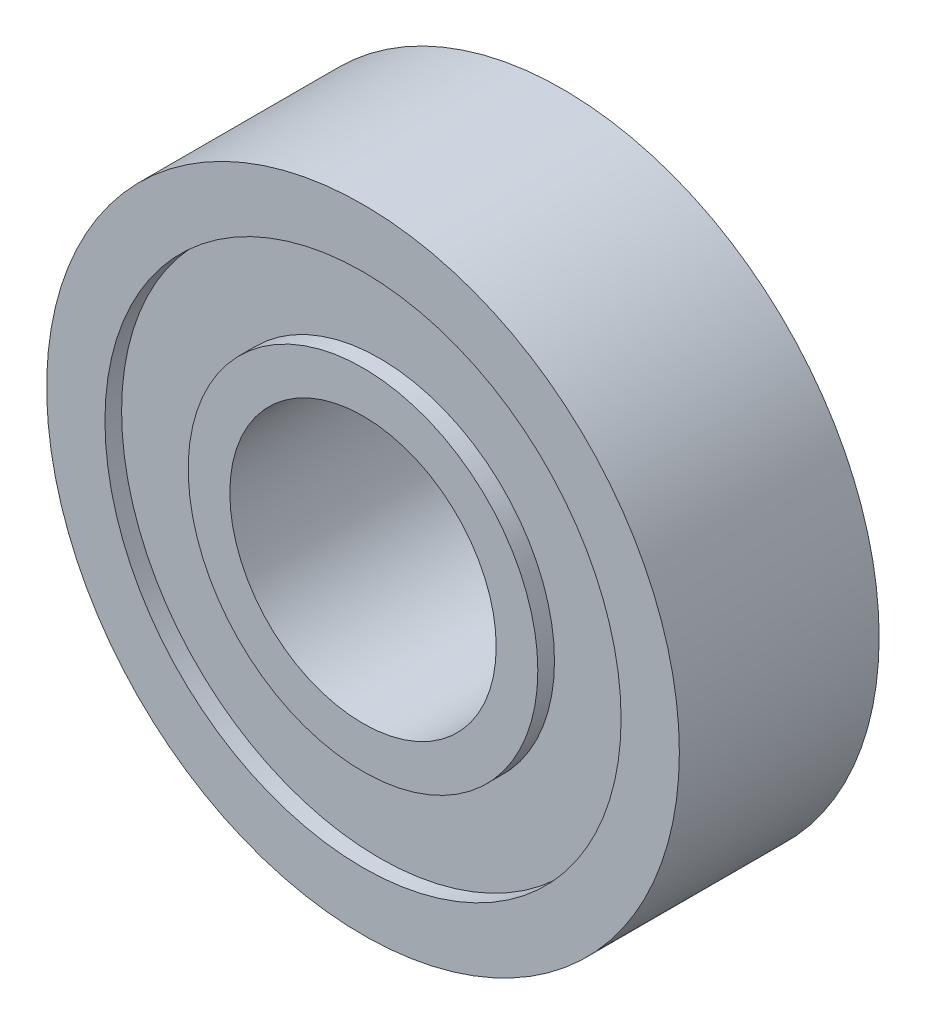
ISO-10303-21;
HEADER;
FILE_DESCRIPTION(('STEP AP214'),'2;1');
FILE_NAME('part.step','',(''),(''),'','','');
FILE_SCHEMA(('AUTOMOTIVE_DESIGN { 1 0 10303 214 1 1 1 1 }'));
ENDSEC;
DATA;
#1=APPLICATION_CONTEXT('core data for automotive mechanical design processes');
#2=APPLICATION_PROTOCOL_DEFINITION('international standard','automotive_design',2000,#1);
#3=PRODUCT_CONTEXT('',#1,'mechanical');
#4=PRODUCT('Part','Part','',(#3));
#5=PRODUCT_RELATED_PRODUCT_CATEGORY('part','',(#4));
#6=PRODUCT_DEFINITION_FORMATION('','',#4);
#7=PRODUCT_DEFINITION_CONTEXT('part definition',#1,'design');
#8=PRODUCT_DEFINITION('design','',#6,#7);
#9=PRODUCT_DEFINITION_SHAPE('','',#8);
#10=(LENGTH_UNIT() NAMED_UNIT(*) SI_UNIT(.MILLI.,.METRE.));
#11=(NAMED_UNIT(*) PLANE_ANGLE_UNIT() SI_UNIT($,.RADIAN.));
#12=(NAMED_UNIT(*) SI_UNIT($,.STERADIAN.) SOLID_ANGLE_UNIT());
#13=UNCERTAINTY_MEASURE_WITH_UNIT(LENGTH_MEASURE(1.E-05),#10,'distance_accuracy_value','');
#14=(GEOMETRIC_REPRESENTATION_CONTEXT(3) GLOBAL_UNCERTAINTY_ASSIGNED_CONTEXT((#13)) GLOBAL_UNIT_ASSIGNED_CONTEXT((#10,
#11,#12)) REPRESENTATION_CONTEXT('',''));
#15=CARTESIAN_POINT('',(0.,0.,0.));
#16=DIRECTION('',(0.,0.,1.));
#17=DIRECTION('',(1.,0.,0.));
#18=AXIS2_PLACEMENT_3D('',#15,#16,#17);
#19=CARTESIAN_POINT('',(0.,0.,-3.));
#20=DIRECTION('',(0.,0.,1.));
#21=DIRECTION('',(1.,0.,0.));
#22=AXIS2_PLACEMENT_3D('',#19,#20,#21);
#23=PLANE('',#22);
#24=CARTESIAN_POINT('',(0.,0.,-3.));
#25=DIRECTION('',(0.,0.,1.));
#26=DIRECTION('',(1.,0.,0.));
#27=AXIS2_PLACEMENT_3D('',#24,#25,#26);
#28=CIRCLE('',#27,4.);
#29=CARTESIAN_POINT('',(4.,0.,-3.));
#30=VERTEX_POINT('',#29);
#31=EDGE_CURVE('E41',#30,#30,#28,.T.);
#32=ORIENTED_EDGE('',*,*,#31,.T.);
#33=EDGE_LOOP('',(#32));
#34=FACE_BOUND('',#33,.T.);
#35=CARTESIAN_POINT('',(0.,0.,-3.));
#36=DIRECTION('',(0.,0.,1.));
#37=DIRECTION('',(1.,0.,0.));
#38=AXIS2_PLACEMENT_3D('',#35,#36,#37);
#39=CIRCLE('',#38,5.25);
#40=CARTESIAN_POINT('',(5.25,0.,-3.));
#41=VERTEX_POINT('',#40);
#42=EDGE_CURVE('E67',#41,#41,#39,.T.);
#43=ORIENTED_EDGE('',*,*,#42,.F.);
#44=EDGE_LOOP('',(#43));
#45=FACE_BOUND('',#44,.T.);
#46=ADVANCED_FACE('F30',(#34,#45),#23,.F.);
#47=CARTESIAN_POINT('',(0.,0.,3.));
#48=DIRECTION('',(0.,0.,1.));
#49=DIRECTION('',(1.,0.,0.));
#50=AXIS2_PLACEMENT_3D('',#47,#48,#49);
#51=PLANE('',#50);
#52=CARTESIAN_POINT('',(0.,0.,3.));
#53=DIRECTION('',(0.,0.,1.));
#54=DIRECTION('',(1.,0.,0.));
#55=AXIS2_PLACEMENT_3D('',#52,#53,#54);
#56=CIRCLE('',#55,4.);
#57=CARTESIAN_POINT('',(4.,0.,3.));
#58=VERTEX_POINT('',#57);
#59=EDGE_CURVE('E43',#58,#58,#56,.T.);
#60=ORIENTED_EDGE('',*,*,#59,.F.);
#61=EDGE_LOOP('',(#60));
#62=FACE_BOUND('',#61,.T.);
#63=CARTESIAN_POINT('',(0.,0.,3.));
#64=DIRECTION('',(0.,0.,1.));
#65=DIRECTION('',(1.,0.,0.));
#66=AXIS2_PLACEMENT_3D('',#63,#64,#65);
#67=CIRCLE('',#66,5.25);
#68=CARTESIAN_POINT('',(5.25,0.,3.));
#69=VERTEX_POINT('',#68);
#70=EDGE_CURVE('E55',#69,#69,#67,.T.);
#71=ORIENTED_EDGE('',*,*,#70,.T.);
#72=EDGE_LOOP('',(#71));
#73=FACE_BOUND('',#72,.T.);
#74=ADVANCED_FACE('F83',(#62,#73),#51,.T.);
#75=CARTESIAN_POINT('',(0.,0.,3.));
#76=DIRECTION('',(0.,0.,-1.));
#77=DIRECTION('',(-1.,0.,0.));
#78=AXIS2_PLACEMENT_3D('',#75,#76,#77);
#79=CYLINDRICAL_SURFACE('',#78,9.5);
#80=CARTESIAN_POINT('',(0.,0.,3.));
#81=DIRECTION('',(0.,0.,1.));
#82=DIRECTION('',(1.,0.,0.));
#83=AXIS2_PLACEMENT_3D('',#80,#81,#82);
#84=CIRCLE('',#83,9.5);
#85=CARTESIAN_POINT('',(9.5,0.,3.));
#86=VERTEX_POINT('',#85);
#87=EDGE_CURVE('E10',#86,#86,#84,.T.);
#88=ORIENTED_EDGE('',*,*,#87,.F.);
#89=EDGE_LOOP('',(#88));
#90=FACE_BOUND('',#89,.T.);
#91=CARTESIAN_POINT('',(0.,0.,-3.));
#92=DIRECTION('',(0.,0.,1.));
#93=DIRECTION('',(1.,0.,0.));
#94=AXIS2_PLACEMENT_3D('',#91,#92,#93);
#95=CIRCLE('',#94,9.5);
#96=CARTESIAN_POINT('',(9.5,0.,-3.));
#97=VERTEX_POINT('',#96);
#98=EDGE_CURVE('E34',#97,#97,#95,.T.);
#99=ORIENTED_EDGE('',*,*,#98,.T.);
#100=EDGE_LOOP('',(#99));
#101=FACE_BOUND('',#100,.T.);
#102=ADVANCED_FACE('F32',(#90,#101),#79,.T.);
#103=CARTESIAN_POINT('',(0.,0.,3.));
#104=DIRECTION('',(0.,0.,1.));
#105=DIRECTION('',(1.,0.,0.));
#106=AXIS2_PLACEMENT_3D('',#103,#104,#105);
#107=CIRCLE('',#106,7.75);
#108=CARTESIAN_POINT('',(7.75,0.,3.));
#109=VERTEX_POINT('',#108);
#110=EDGE_CURVE('E49',#109,#109,#107,.T.);
#111=ORIENTED_EDGE('',*,*,#110,.F.);
#112=EDGE_LOOP('',(#111));
#113=FACE_BOUND('',#112,.T.);
#114=ORIENTED_EDGE('',*,*,#87,.T.);
#115=EDGE_LOOP('',(#114));
#116=FACE_BOUND('',#115,.T.);
#117=ADVANCED_FACE('F91',(#113,#116),#51,.T.);
#118=CARTESIAN_POINT('',(0.,0.,-3.));
#119=DIRECTION('',(0.,0.,1.));
#120=DIRECTION('',(1.,0.,0.));
#121=AXIS2_PLACEMENT_3D('',#118,#119,#120);
#122=CIRCLE('',#121,7.75);
#123=CARTESIAN_POINT('',(7.75,0.,-3.));
#124=VERTEX_POINT('',#123);
#125=EDGE_CURVE('E61',#124,#124,#122,.T.);
#126=ORIENTED_EDGE('',*,*,#125,.T.);
#127=EDGE_LOOP('',(#126));
#128=FACE_BOUND('',#127,.T.);
#129=ORIENTED_EDGE('',*,*,#98,.F.);
#130=EDGE_LOOP('',(#129));
#131=FACE_BOUND('',#130,.T.);
#132=ADVANCED_FACE('F85',(#128,#131),#23,.F.);
#133=CARTESIAN_POINT('',(0.,0.,-3.));
#134=DIRECTION('',(0.,0.,1.));
#135=DIRECTION('',(1.,0.,0.));
#136=AXIS2_PLACEMENT_3D('',#133,#134,#135);
#137=CYLINDRICAL_SURFACE('',#136,4.);
#138=ORIENTED_EDGE('',*,*,#31,.F.);
#139=EDGE_LOOP('',(#138));
#140=FACE_BOUND('',#139,.T.);
#141=ORIENTED_EDGE('',*,*,#59,.T.);
#142=EDGE_LOOP('',(#141));
#143=FACE_BOUND('',#142,.T.);
#144=ADVANCED_FACE('F93',(#140,#143),#137,.F.);
#145=CARTESIAN_POINT('',(0.,0.,2.5));
#146=DIRECTION('',(0.,0.,1.));
#147=DIRECTION('',(1.,0.,0.));
#148=AXIS2_PLACEMENT_3D('',#145,#146,#147);
#149=CYLINDRICAL_SURFACE('',#148,7.75);
#150=CARTESIAN_POINT('',(0.,0.,2.5));
#151=DIRECTION('',(0.,0.,1.));
#152=DIRECTION('',(1.,0.,0.));
#153=AXIS2_PLACEMENT_3D('',#150,#151,#152);
#154=CIRCLE('',#153,7.75);
#155=CARTESIAN_POINT('',(7.75,0.,2.5));
#156=VERTEX_POINT('',#155);
#157=EDGE_CURVE('E46',#156,#156,#154,.T.);
#158=ORIENTED_EDGE('',*,*,#157,.F.);
#159=EDGE_LOOP('',(#158));
#160=FACE_BOUND('',#159,.T.);
#161=ORIENTED_EDGE('',*,*,#110,.T.);
#162=EDGE_LOOP('',(#161));
#163=FACE_BOUND('',#162,.T.);
#164=ADVANCED_FACE('F99',(#160,#163),#149,.F.);
#165=CARTESIAN_POINT('',(0.,0.,2.5));
#166=DIRECTION('',(0.,0.,1.));
#167=DIRECTION('',(1.,0.,0.));
#168=AXIS2_PLACEMENT_3D('',#165,#166,#167);
#169=PLANE('',#168);
#170=CARTESIAN_POINT('',(0.,0.,2.5));
#171=DIRECTION('',(0.,0.,1.));
#172=DIRECTION('',(1.,0.,0.));
#173=AXIS2_PLACEMENT_3D('',#170,#171,#172);
#174=CIRCLE('',#173,5.25);
#175=CARTESIAN_POINT('',(5.25,0.,2.5));
#176=VERTEX_POINT('',#175);
#177=EDGE_CURVE('E52',#176,#176,#174,.T.);
#178=ORIENTED_EDGE('',*,*,#177,.F.);
#179=EDGE_LOOP('',(#178));
#180=FACE_BOUND('',#179,.T.);
#181=ORIENTED_EDGE('',*,*,#157,.T.);
#182=EDGE_LOOP('',(#181));
#183=FACE_BOUND('',#182,.T.);
#184=ADVANCED_FACE('F130',(#180,#183),#169,.T.);
#185=CARTESIAN_POINT('',(0.,0.,2.5));
#186=DIRECTION('',(0.,0.,1.));
#187=DIRECTION('',(1.,0.,0.));
#188=AXIS2_PLACEMENT_3D('',#185,#186,#187);
#189=CYLINDRICAL_SURFACE('',#188,5.25);
#190=ORIENTED_EDGE('',*,*,#177,.T.);
#191=EDGE_LOOP('',(#190));
#192=FACE_BOUND('',#191,.T.);
#193=ORIENTED_EDGE('',*,*,#70,.F.);
#194=EDGE_LOOP('',(#193));
#195=FACE_BOUND('',#194,.T.);
#196=ADVANCED_FACE('F140',(#192,#195),#189,.T.);
#197=CARTESIAN_POINT('',(0.,0.,-2.5));
#198=DIRECTION('',(0.,0.,-1.));
#199=DIRECTION('',(1.,0.,0.));
#200=AXIS2_PLACEMENT_3D('',#197,#198,#199);
#201=PLANE('',#200);
#202=CARTESIAN_POINT('',(0.,0.,-2.5));
#203=DIRECTION('',(0.,0.,1.));
#204=DIRECTION('',(1.,0.,0.));
#205=AXIS2_PLACEMENT_3D('',#202,#203,#204);
#206=CIRCLE('',#205,7.75);
#207=CARTESIAN_POINT('',(7.75,0.,-2.5));
#208=VERTEX_POINT('',#207);
#209=EDGE_CURVE('E58',#208,#208,#206,.T.);
#210=ORIENTED_EDGE('',*,*,#209,.F.);
#211=EDGE_LOOP('',(#210));
#212=FACE_BOUND('',#211,.T.);
#213=CARTESIAN_POINT('',(0.,0.,-2.5));
#214=DIRECTION('',(0.,0.,1.));
#215=DIRECTION('',(1.,0.,0.));
#216=AXIS2_PLACEMENT_3D('',#213,#214,#215);
#217=CIRCLE('',#216,5.25);
#218=CARTESIAN_POINT('',(5.25,0.,-2.5));
#219=VERTEX_POINT('',#218);
#220=EDGE_CURVE('E64',#219,#219,#217,.T.);
#221=ORIENTED_EDGE('',*,*,#220,.T.);
#222=EDGE_LOOP('',(#221));
#223=FACE_BOUND('',#222,.T.);
#224=ADVANCED_FACE('F73',(#212,#223),#201,.T.);
#225=CARTESIAN_POINT('',(0.,0.,-2.5));
#226=DIRECTION('',(0.,0.,-1.));
#227=DIRECTION('',(-1.,0.,0.));
#228=AXIS2_PLACEMENT_3D('',#225,#226,#227);
#229=CYLINDRICAL_SURFACE('',#228,7.75);
#230=ORIENTED_EDGE('',*,*,#209,.T.);
#231=EDGE_LOOP('',(#230));
#232=FACE_BOUND('',#231,.T.);
#233=ORIENTED_EDGE('',*,*,#125,.F.);
#234=EDGE_LOOP('',(#233));
#235=FACE_BOUND('',#234,.T.);
#236=ADVANCED_FACE('F78',(#232,#235),#229,.F.);
#237=CARTESIAN_POINT('',(0.,0.,-2.5));
#238=DIRECTION('',(0.,0.,-1.));
#239=DIRECTION('',(-1.,0.,0.));
#240=AXIS2_PLACEMENT_3D('',#237,#238,#239);
#241=CYLINDRICAL_SURFACE('',#240,5.25);
#242=ORIENTED_EDGE('',*,*,#220,.F.);
#243=EDGE_LOOP('',(#242));
#244=FACE_BOUND('',#243,.T.);
#245=ORIENTED_EDGE('',*,*,#42,.T.);
#246=EDGE_LOOP('',(#245));
#247=FACE_BOUND('',#246,.T.);
#248=ADVANCED_FACE('F75',(#244,#247),#241,.T.);
#249=CLOSED_SHELL('',(#46,#74,#102,#117,#132,#144,#164,#184,#196,#224,#236,#248));
#250=MANIFOLD_SOLID_BREP('B2',#249);
#251=ADVANCED_BREP_SHAPE_REPRESENTATION('',(#18,#250),#14);
#252=SHAPE_DEFINITION_REPRESENTATION(#9,#251);
ENDSEC;
END-ISO-10303-21;
